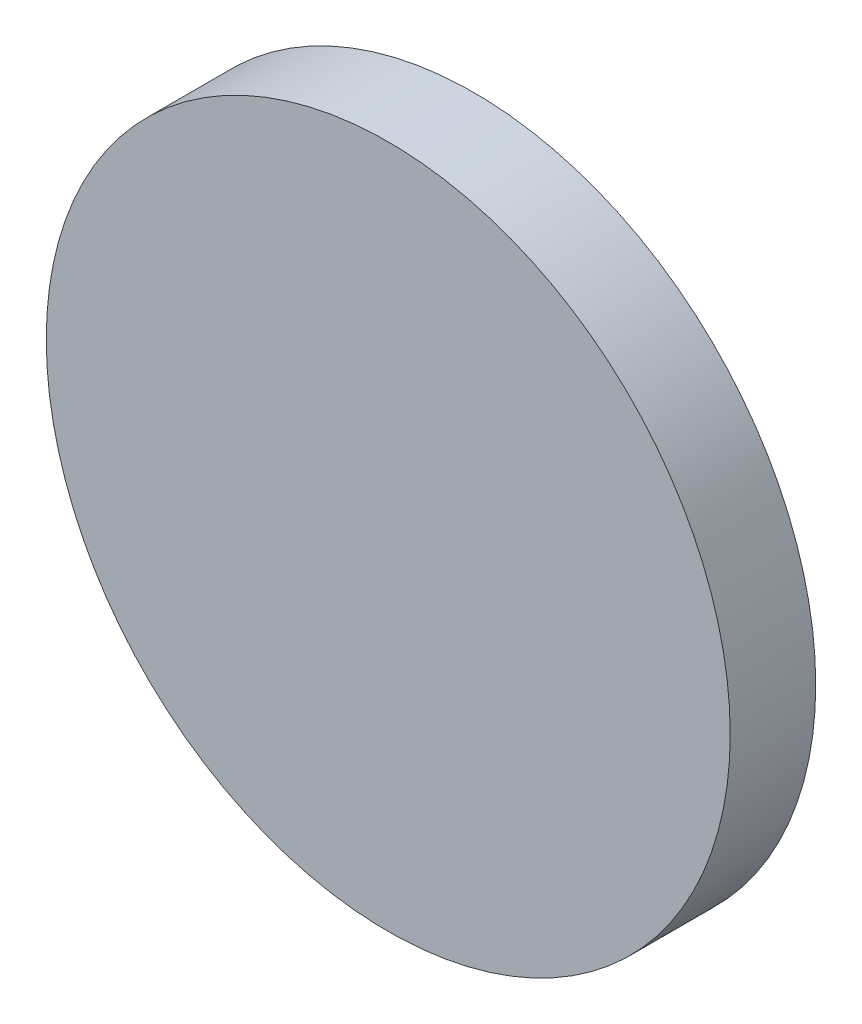
ISO-10303-21;
HEADER;
FILE_DESCRIPTION(('STEP AP214'),'2;1');
FILE_NAME('part.step','',(''),(''),'','','');
FILE_SCHEMA(('AUTOMOTIVE_DESIGN { 1 0 10303 214 1 1 1 1 }'));
ENDSEC;
DATA;
#1=APPLICATION_CONTEXT('core data for automotive mechanical design processes');
#2=APPLICATION_PROTOCOL_DEFINITION('international standard','automotive_design',2000,#1);
#3=PRODUCT_CONTEXT('',#1,'mechanical');
#4=PRODUCT('Part','Part','',(#3));
#5=PRODUCT_RELATED_PRODUCT_CATEGORY('part','',(#4));
#6=PRODUCT_DEFINITION_FORMATION('','',#4);
#7=PRODUCT_DEFINITION_CONTEXT('part definition',#1,'design');
#8=PRODUCT_DEFINITION('design','',#6,#7);
#9=PRODUCT_DEFINITION_SHAPE('','',#8);
#10=(LENGTH_UNIT() NAMED_UNIT(*) SI_UNIT(.MILLI.,.METRE.));
#11=(NAMED_UNIT(*) PLANE_ANGLE_UNIT() SI_UNIT($,.RADIAN.));
#12=(NAMED_UNIT(*) SI_UNIT($,.STERADIAN.) SOLID_ANGLE_UNIT());
#13=UNCERTAINTY_MEASURE_WITH_UNIT(LENGTH_MEASURE(1.E-05),#10,'distance_accuracy_value','');
#14=(GEOMETRIC_REPRESENTATION_CONTEXT(3) GLOBAL_UNCERTAINTY_ASSIGNED_CONTEXT((#13)) GLOBAL_UNIT_ASSIGNED_CONTEXT((#10,
#11,#12)) REPRESENTATION_CONTEXT('',''));
#15=CARTESIAN_POINT('',(0.,0.,0.));
#16=DIRECTION('',(0.,0.,1.));
#17=DIRECTION('',(1.,0.,0.));
#18=AXIS2_PLACEMENT_3D('',#15,#16,#17);
#19=CARTESIAN_POINT('',(0.,0.,10.));
#20=DIRECTION('',(0.,0.,-1.));
#21=DIRECTION('',(-1.,0.,0.));
#22=AXIS2_PLACEMENT_3D('',#19,#20,#21);
#23=CYLINDRICAL_SURFACE('',#22,40.);
#24=CARTESIAN_POINT('',(0.,0.,10.));
#25=DIRECTION('',(0.,0.,1.));
#26=DIRECTION('',(1.,0.,0.));
#27=AXIS2_PLACEMENT_3D('',#24,#25,#26);
#28=CIRCLE('',#27,40.);
#29=CARTESIAN_POINT('',(40.,0.,10.));
#30=VERTEX_POINT('',#29);
#31=EDGE_CURVE('E10',#30,#30,#28,.T.);
#32=ORIENTED_EDGE('',*,*,#31,.F.);
#33=EDGE_LOOP('',(#32));
#34=FACE_BOUND('',#33,.T.);
#35=CARTESIAN_POINT('',(0.,0.,0.));
#36=DIRECTION('',(0.,0.,1.));
#37=DIRECTION('',(1.,0.,0.));
#38=AXIS2_PLACEMENT_3D('',#35,#36,#37);
#39=CIRCLE('',#38,40.);
#40=CARTESIAN_POINT('',(40.,0.,0.));
#41=VERTEX_POINT('',#40);
#42=EDGE_CURVE('E35',#41,#41,#39,.T.);
#43=ORIENTED_EDGE('',*,*,#42,.T.);
#44=EDGE_LOOP('',(#43));
#45=FACE_BOUND('',#44,.T.);
#46=ADVANCED_FACE('F32',(#34,#45),#23,.T.);
#47=CARTESIAN_POINT('',(0.,0.,10.));
#48=DIRECTION('',(0.,0.,1.));
#49=DIRECTION('',(1.,0.,0.));
#50=AXIS2_PLACEMENT_3D('',#47,#48,#49);
#51=PLANE('',#50);
#52=ORIENTED_EDGE('',*,*,#31,.T.);
#53=EDGE_LOOP('',(#52));
#54=FACE_BOUND('',#53,.T.);
#55=ADVANCED_FACE('F47',(#54),#51,.T.);
#56=CARTESIAN_POINT('',(0.,0.,0.));
#57=DIRECTION('',(0.,0.,1.));
#58=DIRECTION('',(1.,0.,0.));
#59=AXIS2_PLACEMENT_3D('',#56,#57,#58);
#60=PLANE('',#59);
#61=ORIENTED_EDGE('',*,*,#42,.F.);
#62=EDGE_LOOP('',(#61));
#63=FACE_BOUND('',#62,.T.);
#64=ADVANCED_FACE('F45',(#63),#60,.F.);
#65=CLOSED_SHELL('',(#46,#55,#64));
#66=MANIFOLD_SOLID_BREP('B2',#65);
#67=ADVANCED_BREP_SHAPE_REPRESENTATION('',(#18,#66),#14);
#68=SHAPE_DEFINITION_REPRESENTATION(#9,#67);
ENDSEC;
END-ISO-10303-21;
